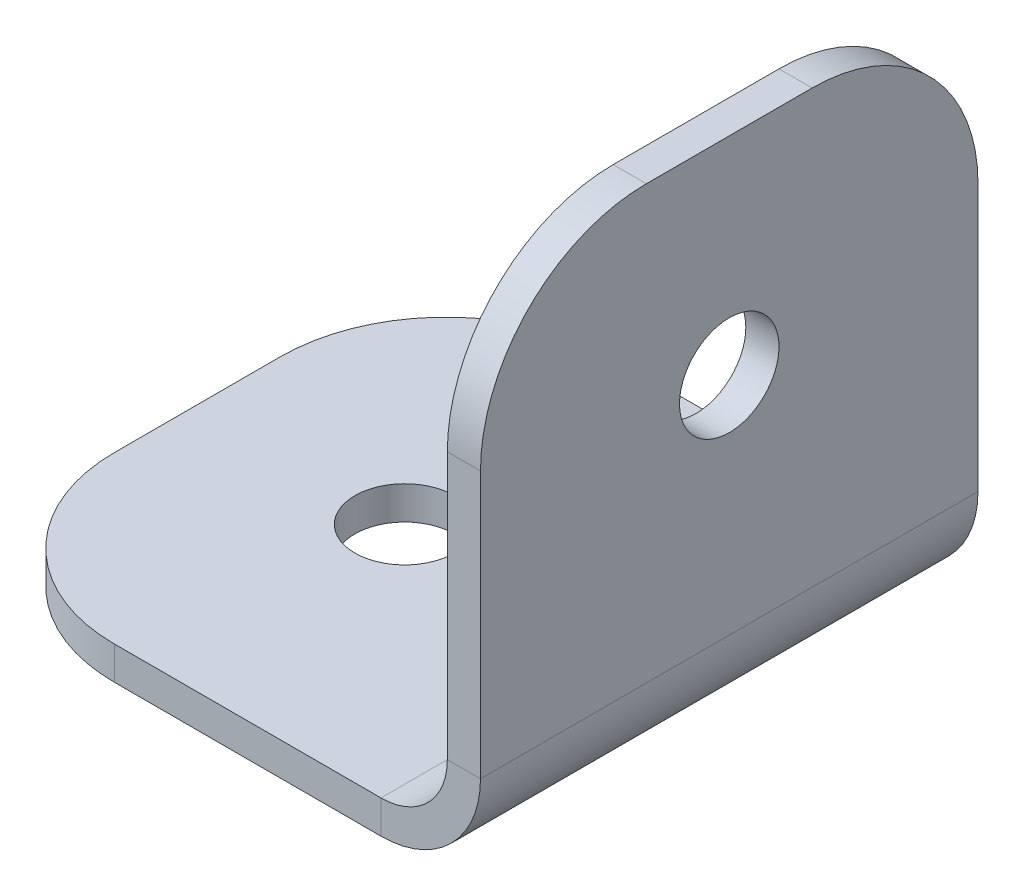
ISO-10303-21;
HEADER;
FILE_DESCRIPTION(('STEP AP214'),'2;1');
FILE_NAME('part.step','',(''),(''),'','','');
FILE_SCHEMA(('AUTOMOTIVE_DESIGN { 1 0 10303 214 1 1 1 1 }'));
ENDSEC;
DATA;
#1=APPLICATION_CONTEXT('core data for automotive mechanical design processes');
#2=APPLICATION_PROTOCOL_DEFINITION('international standard','automotive_design',2000,#1);
#3=PRODUCT_CONTEXT('',#1,'mechanical');
#4=PRODUCT('Part','Part','',(#3));
#5=PRODUCT_RELATED_PRODUCT_CATEGORY('part','',(#4));
#6=PRODUCT_DEFINITION_FORMATION('','',#4);
#7=PRODUCT_DEFINITION_CONTEXT('part definition',#1,'design');
#8=PRODUCT_DEFINITION('design','',#6,#7);
#9=PRODUCT_DEFINITION_SHAPE('','',#8);
#10=(LENGTH_UNIT() NAMED_UNIT(*) SI_UNIT(.MILLI.,.METRE.));
#11=(NAMED_UNIT(*) PLANE_ANGLE_UNIT() SI_UNIT($,.RADIAN.));
#12=(NAMED_UNIT(*) SI_UNIT($,.STERADIAN.) SOLID_ANGLE_UNIT());
#13=UNCERTAINTY_MEASURE_WITH_UNIT(LENGTH_MEASURE(1.E-05),#10,'distance_accuracy_value','');
#14=(GEOMETRIC_REPRESENTATION_CONTEXT(3) GLOBAL_UNCERTAINTY_ASSIGNED_CONTEXT((#13)) GLOBAL_UNIT_ASSIGNED_CONTEXT((#10,
#11,#12)) REPRESENTATION_CONTEXT('',''));
#15=CARTESIAN_POINT('',(0.,0.,0.));
#16=DIRECTION('',(0.,0.,1.));
#17=DIRECTION('',(1.,0.,0.));
#18=AXIS2_PLACEMENT_3D('',#15,#16,#17);
#19=CARTESIAN_POINT('',(0.0730091830128251,-17.9269908169872,-4.99999999999999));
#20=DIRECTION('',(1.,0.,0.));
#21=DIRECTION('',(0.,0.,-1.));
#22=AXIS2_PLACEMENT_3D('',#19,#20,#21);
#23=PLANE('',#22);
#24=CARTESIAN_POINT('',(0.073009183012692,19.5730091830128,0.));
#25=DIRECTION('',(-1.,0.,0.));
#26=DIRECTION('',(0.,0.,-1.));
#27=AXIS2_PLACEMENT_3D('',#24,#25,#26);
#28=CIRCLE('',#27,3.);
#29=CARTESIAN_POINT('',(0.0730091830126934,19.5730091830128,-3.00000000000001));
#30=VERTEX_POINT('',#29);
#31=EDGE_CURVE('E204',#30,#30,#28,.T.);
#32=ORIENTED_EDGE('',*,*,#31,.F.);
#33=EDGE_LOOP('',(#32));
#34=FACE_BOUND('',#33,.T.);
#35=DIRECTION('',(0.,-1.,0.));
#36=VECTOR('',#35,1.);
#37=CARTESIAN_POINT('',(0.0730091830128299,-17.9269908169872,-15.));
#38=LINE('',#37,#36);
#39=CARTESIAN_POINT('',(0.0730091830126903,22.0730091830128,-15.));
#40=VERTEX_POINT('',#39);
#41=CARTESIAN_POINT('',(0.0730091830127462,6.00000000000001,-15.));
#42=VERTEX_POINT('',#41);
#43=EDGE_CURVE('E42',#40,#42,#38,.T.);
#44=ORIENTED_EDGE('',*,*,#43,.T.);
#45=DIRECTION('',(0.,0.,1.));
#46=VECTOR('',#45,1.);
#47=CARTESIAN_POINT('',(0.0730091830127414,6.00000000000002,-4.99999999999999));
#48=LINE('',#47,#46);
#49=CARTESIAN_POINT('',(0.0730091830127401,6.00000000000002,15.));
#50=VERTEX_POINT('',#49);
#51=EDGE_CURVE('E151',#42,#50,#48,.T.);
#52=ORIENTED_EDGE('',*,*,#51,.T.);
#53=DIRECTION('',(0.,1.,0.));
#54=VECTOR('',#53,1.);
#55=CARTESIAN_POINT('',(0.073009183012816,-17.9269908169872,15.));
#56=LINE('',#55,#54);
#57=CARTESIAN_POINT('',(0.0730091830126764,22.0730091830128,15.));
#58=VERTEX_POINT('',#57);
#59=EDGE_CURVE('E198',#50,#58,#56,.T.);
#60=ORIENTED_EDGE('',*,*,#59,.T.);
#61=CARTESIAN_POINT('',(0.0730091830126811,22.0730091830128,4.99999999999999));
#62=DIRECTION('',(-1.,0.,0.));
#63=DIRECTION('',(0.,0.,1.));
#64=AXIS2_PLACEMENT_3D('',#61,#62,#63);
#65=CIRCLE('',#64,10.);
#66=CARTESIAN_POINT('',(0.073009183012646,32.0730091830128,4.99999999999999));
#67=VERTEX_POINT('',#66);
#68=EDGE_CURVE('E194',#58,#67,#65,.T.);
#69=ORIENTED_EDGE('',*,*,#68,.T.);
#70=DIRECTION('',(0.,0.,-1.));
#71=VECTOR('',#70,1.);
#72=CARTESIAN_POINT('',(0.073009183012646,32.0730091830128,4.99999999999999));
#73=LINE('',#72,#71);
#74=CARTESIAN_POINT('',(0.0730091830126504,32.0730091830128,-5.00000000000001));
#75=VERTEX_POINT('',#74);
#76=EDGE_CURVE('E197',#67,#75,#73,.T.);
#77=ORIENTED_EDGE('',*,*,#76,.T.);
#78=CARTESIAN_POINT('',(0.0730091830126855,22.0730091830128,-5.00000000000001));
#79=DIRECTION('',(-1.,0.,0.));
#80=DIRECTION('',(0.,0.,-1.));
#81=AXIS2_PLACEMENT_3D('',#78,#79,#80);
#82=CIRCLE('',#81,10.);
#83=EDGE_CURVE('E201',#75,#40,#82,.T.);
#84=ORIENTED_EDGE('',*,*,#83,.T.);
#85=EDGE_LOOP('',(#44,#52,#60,#69,#77,#84));
#86=FACE_BOUND('',#85,.T.);
#87=ADVANCED_FACE('F38',(#34,#86),#23,.F.);
#88=CARTESIAN_POINT('',(0.073009183012816,-17.9269908169872,15.));
#89=DIRECTION('',(0.,0.,-1.));
#90=DIRECTION('',(0.,1.,0.));
#91=AXIS2_PLACEMENT_3D('',#88,#89,#90);
#92=PLANE('',#91);
#93=DIRECTION('',(-1.,0.,0.));
#94=VECTOR('',#93,1.);
#95=CARTESIAN_POINT('',(0.0730091830127323,6.00000000000002,15.));
#96=LINE('',#95,#94);
#97=CARTESIAN_POINT('',(2.07300918301273,6.00000000000003,15.));
#98=VERTEX_POINT('',#97);
#99=EDGE_CURVE('E12',#98,#50,#96,.T.);
#100=ORIENTED_EDGE('',*,*,#99,.F.);
#101=DIRECTION('',(0.,1.,0.));
#102=VECTOR('',#101,1.);
#103=CARTESIAN_POINT('',(2.07300918301282,-17.9269908169872,15.));
#104=LINE('',#103,#102);
#105=CARTESIAN_POINT('',(2.07300918301268,22.0730091830128,15.));
#106=VERTEX_POINT('',#105);
#107=EDGE_CURVE('E55',#98,#106,#104,.T.);
#108=ORIENTED_EDGE('',*,*,#107,.T.);
#109=DIRECTION('',(-1.,0.,0.));
#110=VECTOR('',#109,1.);
#111=CARTESIAN_POINT('',(0.0730091830126764,22.0730091830128,15.));
#112=LINE('',#111,#110);
#113=EDGE_CURVE('E225',#106,#58,#112,.T.);
#114=ORIENTED_EDGE('',*,*,#113,.T.);
#115=ORIENTED_EDGE('',*,*,#59,.F.);
#116=EDGE_LOOP('',(#100,#108,#114,#115));
#117=FACE_BOUND('',#116,.T.);
#118=ADVANCED_FACE('F40',(#117),#92,.F.);
#119=CARTESIAN_POINT('',(0.0730091830126811,22.0730091830128,4.99999999999999));
#120=DIRECTION('',(-1.,0.,0.));
#121=DIRECTION('',(0.,0.,1.));
#122=AXIS2_PLACEMENT_3D('',#119,#120,#121);
#123=CYLINDRICAL_SURFACE('',#122,10.);
#124=ORIENTED_EDGE('',*,*,#113,.F.);
#125=CARTESIAN_POINT('',(2.07300918301268,22.0730091830128,4.99999999999999));
#126=DIRECTION('',(-1.,0.,0.));
#127=DIRECTION('',(0.,0.,1.));
#128=AXIS2_PLACEMENT_3D('',#125,#126,#127);
#129=CIRCLE('',#128,10.);
#130=CARTESIAN_POINT('',(2.07300918301265,32.0730091830128,4.99999999999999));
#131=VERTEX_POINT('',#130);
#132=EDGE_CURVE('E214',#106,#131,#129,.T.);
#133=ORIENTED_EDGE('',*,*,#132,.T.);
#134=DIRECTION('',(-1.,0.,0.));
#135=VECTOR('',#134,1.);
#136=CARTESIAN_POINT('',(0.073009183012646,32.0730091830128,4.99999999999999));
#137=LINE('',#136,#135);
#138=EDGE_CURVE('E223',#131,#67,#137,.T.);
#139=ORIENTED_EDGE('',*,*,#138,.T.);
#140=ORIENTED_EDGE('',*,*,#68,.F.);
#141=EDGE_LOOP('',(#124,#133,#139,#140));
#142=FACE_BOUND('',#141,.T.);
#143=ADVANCED_FACE('F241',(#142),#123,.T.);
#144=CARTESIAN_POINT('',(0.073009183012646,32.0730091830128,4.99999999999999));
#145=DIRECTION('',(0.,-1.,0.));
#146=DIRECTION('',(0.,0.,-1.));
#147=AXIS2_PLACEMENT_3D('',#144,#145,#146);
#148=PLANE('',#147);
#149=ORIENTED_EDGE('',*,*,#138,.F.);
#150=DIRECTION('',(0.,0.,-1.));
#151=VECTOR('',#150,1.);
#152=CARTESIAN_POINT('',(2.07300918301265,32.0730091830128,-5.00000000000001));
#153=LINE('',#152,#151);
#154=CARTESIAN_POINT('',(2.07300918301265,32.0730091830128,-5.00000000000001));
#155=VERTEX_POINT('',#154);
#156=EDGE_CURVE('E211',#131,#155,#153,.T.);
#157=ORIENTED_EDGE('',*,*,#156,.T.);
#158=DIRECTION('',(-1.,0.,0.));
#159=VECTOR('',#158,1.);
#160=CARTESIAN_POINT('',(0.0730091830126504,32.0730091830128,-5.00000000000001));
#161=LINE('',#160,#159);
#162=EDGE_CURVE('E221',#155,#75,#161,.T.);
#163=ORIENTED_EDGE('',*,*,#162,.T.);
#164=ORIENTED_EDGE('',*,*,#76,.F.);
#165=EDGE_LOOP('',(#149,#157,#163,#164));
#166=FACE_BOUND('',#165,.T.);
#167=ADVANCED_FACE('F244',(#166),#148,.F.);
#168=CARTESIAN_POINT('',(0.0730091830126855,22.0730091830128,-5.00000000000001));
#169=DIRECTION('',(-1.,0.,0.));
#170=DIRECTION('',(0.,0.,1.));
#171=AXIS2_PLACEMENT_3D('',#168,#169,#170);
#172=CYLINDRICAL_SURFACE('',#171,10.);
#173=ORIENTED_EDGE('',*,*,#162,.F.);
#174=CARTESIAN_POINT('',(2.07300918301269,22.0730091830128,-5.00000000000001));
#175=DIRECTION('',(-1.,0.,0.));
#176=DIRECTION('',(0.,0.,1.));
#177=AXIS2_PLACEMENT_3D('',#174,#175,#176);
#178=CIRCLE('',#177,10.);
#179=CARTESIAN_POINT('',(2.07300918301269,22.0730091830128,-15.));
#180=VERTEX_POINT('',#179);
#181=EDGE_CURVE('E208',#155,#180,#178,.T.);
#182=ORIENTED_EDGE('',*,*,#181,.T.);
#183=DIRECTION('',(-1.,0.,0.));
#184=VECTOR('',#183,1.);
#185=CARTESIAN_POINT('',(0.0730091830126903,22.0730091830128,-15.));
#186=LINE('',#185,#184);
#187=EDGE_CURVE('E207',#180,#40,#186,.T.);
#188=ORIENTED_EDGE('',*,*,#187,.T.);
#189=ORIENTED_EDGE('',*,*,#83,.F.);
#190=EDGE_LOOP('',(#173,#182,#188,#189));
#191=FACE_BOUND('',#190,.T.);
#192=ADVANCED_FACE('F249',(#191),#172,.T.);
#193=CARTESIAN_POINT('',(0.0730091830128299,-17.9269908169872,-15.));
#194=DIRECTION('',(0.,0.,1.));
#195=DIRECTION('',(0.,-1.,0.));
#196=AXIS2_PLACEMENT_3D('',#193,#194,#195);
#197=PLANE('',#196);
#198=DIRECTION('',(1.,0.,0.));
#199=VECTOR('',#198,1.);
#200=CARTESIAN_POINT('',(0.0730091830127462,6.00000000000002,-15.));
#201=LINE('',#200,#199);
#202=CARTESIAN_POINT('',(2.07300918301275,6.00000000000002,-15.));
#203=VERTEX_POINT('',#202);
#204=EDGE_CURVE('E229',#42,#203,#201,.T.);
#205=ORIENTED_EDGE('',*,*,#204,.F.);
#206=ORIENTED_EDGE('',*,*,#43,.F.);
#207=ORIENTED_EDGE('',*,*,#187,.F.);
#208=DIRECTION('',(0.,1.,0.));
#209=VECTOR('',#208,1.);
#210=CARTESIAN_POINT('',(2.07300918301283,-17.9269908169872,-15.));
#211=LINE('',#210,#209);
#212=EDGE_CURVE('E63',#180,#203,#211,.F.);
#213=ORIENTED_EDGE('',*,*,#212,.T.);
#214=EDGE_LOOP('',(#205,#206,#207,#213));
#215=FACE_BOUND('',#214,.T.);
#216=ADVANCED_FACE('F252',(#215),#197,.F.);
#217=CARTESIAN_POINT('',(0.073009183012692,19.5730091830128,0.));
#218=DIRECTION('',(-1.,0.,0.));
#219=DIRECTION('',(0.,0.,1.));
#220=AXIS2_PLACEMENT_3D('',#217,#218,#219);
#221=CYLINDRICAL_SURFACE('',#220,3.);
#222=ORIENTED_EDGE('',*,*,#31,.T.);
#223=EDGE_LOOP('',(#222));
#224=FACE_BOUND('',#223,.T.);
#225=CARTESIAN_POINT('',(2.07300918301269,19.5730091830128,0.));
#226=DIRECTION('',(-1.,0.,0.));
#227=DIRECTION('',(0.,0.,1.));
#228=AXIS2_PLACEMENT_3D('',#225,#226,#227);
#229=CIRCLE('',#228,3.);
#230=CARTESIAN_POINT('',(2.07300918301269,19.5730091830128,2.99999999999999));
#231=VERTEX_POINT('',#230);
#232=EDGE_CURVE('E217',#231,#231,#229,.T.);
#233=ORIENTED_EDGE('',*,*,#232,.F.);
#234=EDGE_LOOP('',(#233));
#235=FACE_BOUND('',#234,.T.);
#236=ADVANCED_FACE('F311',(#224,#235),#221,.F.);
#237=CARTESIAN_POINT('',(2.07300918301283,-17.9269908169872,-4.99999999999999));
#238=DIRECTION('',(1.,0.,0.));
#239=DIRECTION('',(0.,0.,-1.));
#240=AXIS2_PLACEMENT_3D('',#237,#238,#239);
#241=PLANE('',#240);
#242=DIRECTION('',(0.,0.,1.));
#243=VECTOR('',#242,1.);
#244=CARTESIAN_POINT('',(2.07300918301274,6.00000000000003,-4.99999999999999));
#245=LINE('',#244,#243);
#246=EDGE_CURVE('E47',#203,#98,#245,.T.);
#247=ORIENTED_EDGE('',*,*,#246,.F.);
#248=ORIENTED_EDGE('',*,*,#212,.F.);
#249=ORIENTED_EDGE('',*,*,#181,.F.);
#250=ORIENTED_EDGE('',*,*,#156,.F.);
#251=ORIENTED_EDGE('',*,*,#132,.F.);
#252=ORIENTED_EDGE('',*,*,#107,.F.);
#253=EDGE_LOOP('',(#247,#248,#249,#250,#251,#252));
#254=FACE_BOUND('',#253,.T.);
#255=ORIENTED_EDGE('',*,*,#232,.T.);
#256=EDGE_LOOP('',(#255));
#257=FACE_BOUND('',#256,.T.);
#258=ADVANCED_FACE('F246',(#254,#257),#241,.T.);
#259=CARTESIAN_POINT('',(-17.5,2.,0.));
#260=DIRECTION('',(0.,1.,0.));
#261=DIRECTION('',(0.,0.,1.));
#262=AXIS2_PLACEMENT_3D('',#259,#260,#261);
#263=CYLINDRICAL_SURFACE('',#262,3.);
#264=CARTESIAN_POINT('',(-17.5,2.,0.));
#265=DIRECTION('',(0.,1.,0.));
#266=DIRECTION('',(0.,0.,1.));
#267=AXIS2_PLACEMENT_3D('',#264,#265,#266);
#268=CIRCLE('',#267,3.);
#269=CARTESIAN_POINT('',(-17.5,2.,3.));
#270=VERTEX_POINT('',#269);
#271=EDGE_CURVE('E165',#270,#270,#268,.T.);
#272=ORIENTED_EDGE('',*,*,#271,.T.);
#273=EDGE_LOOP('',(#272));
#274=FACE_BOUND('',#273,.T.);
#275=CARTESIAN_POINT('',(-17.5,0.,0.));
#276=DIRECTION('',(0.,1.,0.));
#277=DIRECTION('',(0.,0.,1.));
#278=AXIS2_PLACEMENT_3D('',#275,#276,#277);
#279=CIRCLE('',#278,3.);
#280=CARTESIAN_POINT('',(-17.5,0.,3.));
#281=VERTEX_POINT('',#280);
#282=EDGE_CURVE('E269',#281,#281,#279,.T.);
#283=ORIENTED_EDGE('',*,*,#282,.F.);
#284=EDGE_LOOP('',(#283));
#285=FACE_BOUND('',#284,.T.);
#286=ADVANCED_FACE('F300',(#274,#285),#263,.F.);
#287=CARTESIAN_POINT('',(-20.,2.,5.));
#288=DIRECTION('',(0.,1.,0.));
#289=DIRECTION('',(0.,0.,1.));
#290=AXIS2_PLACEMENT_3D('',#287,#288,#289);
#291=CYLINDRICAL_SURFACE('',#290,10.);
#292=DIRECTION('',(0.,1.,0.));
#293=VECTOR('',#292,1.);
#294=CARTESIAN_POINT('',(-30.,2.,5.));
#295=LINE('',#294,#293);
#296=CARTESIAN_POINT('',(-30.,0.,5.));
#297=VERTEX_POINT('',#296);
#298=CARTESIAN_POINT('',(-30.,2.,5.));
#299=VERTEX_POINT('',#298);
#300=EDGE_CURVE('E182',#297,#299,#295,.T.);
#301=ORIENTED_EDGE('',*,*,#300,.F.);
#302=CARTESIAN_POINT('',(-20.,0.,5.));
#303=DIRECTION('',(0.,1.,0.));
#304=DIRECTION('',(0.,0.,1.));
#305=AXIS2_PLACEMENT_3D('',#302,#303,#304);
#306=CIRCLE('',#305,10.);
#307=CARTESIAN_POINT('',(-20.,0.,15.));
#308=VERTEX_POINT('',#307);
#309=EDGE_CURVE('E189',#297,#308,#306,.T.);
#310=ORIENTED_EDGE('',*,*,#309,.T.);
#311=DIRECTION('',(0.,1.,0.));
#312=VECTOR('',#311,1.);
#313=CARTESIAN_POINT('',(-20.,2.,15.));
#314=LINE('',#313,#312);
#315=CARTESIAN_POINT('',(-20.,2.,15.));
#316=VERTEX_POINT('',#315);
#317=EDGE_CURVE('E187',#308,#316,#314,.T.);
#318=ORIENTED_EDGE('',*,*,#317,.T.);
#319=CARTESIAN_POINT('',(-20.,2.,5.));
#320=DIRECTION('',(0.,1.,0.));
#321=DIRECTION('',(0.,0.,-1.));
#322=AXIS2_PLACEMENT_3D('',#319,#320,#321);
#323=CIRCLE('',#322,10.);
#324=EDGE_CURVE('E275',#299,#316,#323,.T.);
#325=ORIENTED_EDGE('',*,*,#324,.F.);
#326=EDGE_LOOP('',(#301,#310,#318,#325));
#327=FACE_BOUND('',#326,.T.);
#328=ADVANCED_FACE('F281',(#327),#291,.T.);
#329=CARTESIAN_POINT('',(-30.,2.,5.));
#330=DIRECTION('',(1.,0.,0.));
#331=DIRECTION('',(0.,0.,1.));
#332=AXIS2_PLACEMENT_3D('',#329,#330,#331);
#333=PLANE('',#332);
#334=DIRECTION('',(0.,0.,-1.));
#335=VECTOR('',#334,1.);
#336=CARTESIAN_POINT('',(-30.,0.,-5.));
#337=LINE('',#336,#335);
#338=CARTESIAN_POINT('',(-30.,0.,-5.));
#339=VERTEX_POINT('',#338);
#340=EDGE_CURVE('E184',#339,#297,#337,.F.);
#341=ORIENTED_EDGE('',*,*,#340,.T.);
#342=ORIENTED_EDGE('',*,*,#300,.T.);
#343=DIRECTION('',(0.,0.,1.));
#344=VECTOR('',#343,1.);
#345=CARTESIAN_POINT('',(-30.,2.,5.));
#346=LINE('',#345,#344);
#347=CARTESIAN_POINT('',(-30.,2.,-5.));
#348=VERTEX_POINT('',#347);
#349=EDGE_CURVE('E174',#348,#299,#346,.T.);
#350=ORIENTED_EDGE('',*,*,#349,.F.);
#351=DIRECTION('',(0.,1.,0.));
#352=VECTOR('',#351,1.);
#353=CARTESIAN_POINT('',(-30.,2.,-5.));
#354=LINE('',#353,#352);
#355=EDGE_CURVE('E172',#339,#348,#354,.T.);
#356=ORIENTED_EDGE('',*,*,#355,.F.);
#357=EDGE_LOOP('',(#341,#342,#350,#356));
#358=FACE_BOUND('',#357,.T.);
#359=ADVANCED_FACE('F292',(#358),#333,.F.);
#360=CARTESIAN_POINT('',(-20.,2.,-5.));
#361=DIRECTION('',(0.,1.,0.));
#362=DIRECTION('',(0.,0.,1.));
#363=AXIS2_PLACEMENT_3D('',#360,#361,#362);
#364=CYLINDRICAL_SURFACE('',#363,10.);
#365=DIRECTION('',(0.,1.,0.));
#366=VECTOR('',#365,1.);
#367=CARTESIAN_POINT('',(-20.,2.,-15.));
#368=LINE('',#367,#366);
#369=CARTESIAN_POINT('',(-20.,0.,-15.));
#370=VERTEX_POINT('',#369);
#371=CARTESIAN_POINT('',(-20.,2.,-15.));
#372=VERTEX_POINT('',#371);
#373=EDGE_CURVE('E169',#370,#372,#368,.T.);
#374=ORIENTED_EDGE('',*,*,#373,.F.);
#375=CARTESIAN_POINT('',(-20.,0.,-5.));
#376=DIRECTION('',(0.,1.,0.));
#377=DIRECTION('',(0.,0.,1.));
#378=AXIS2_PLACEMENT_3D('',#375,#376,#377);
#379=CIRCLE('',#378,10.);
#380=EDGE_CURVE('E176',#370,#339,#379,.T.);
#381=ORIENTED_EDGE('',*,*,#380,.T.);
#382=ORIENTED_EDGE('',*,*,#355,.T.);
#383=CARTESIAN_POINT('',(-20.,2.,-5.));
#384=DIRECTION('',(0.,1.,0.));
#385=DIRECTION('',(0.,0.,-1.));
#386=AXIS2_PLACEMENT_3D('',#383,#384,#385);
#387=CIRCLE('',#386,10.);
#388=EDGE_CURVE('E171',#372,#348,#387,.T.);
#389=ORIENTED_EDGE('',*,*,#388,.F.);
#390=EDGE_LOOP('',(#374,#381,#382,#389));
#391=FACE_BOUND('',#390,.T.);
#392=ADVANCED_FACE('F291',(#391),#364,.T.);
#393=CARTESIAN_POINT('',(-20.,2.,-5.));
#394=DIRECTION('',(0.,-1.,0.));
#395=DIRECTION('',(0.,0.,-1.));
#396=AXIS2_PLACEMENT_3D('',#393,#394,#395);
#397=PLANE('',#396);
#398=DIRECTION('',(0.,0.,1.));
#399=VECTOR('',#398,1.);
#400=CARTESIAN_POINT('',(-3.92699081698725,2.,-4.99999999999999));
#401=LINE('',#400,#399);
#402=CARTESIAN_POINT('',(-3.92699081698725,2.,-15.));
#403=VERTEX_POINT('',#402);
#404=CARTESIAN_POINT('',(-3.92699081698726,2.,15.));
#405=VERTEX_POINT('',#404);
#406=EDGE_CURVE('E148',#403,#405,#401,.T.);
#407=ORIENTED_EDGE('',*,*,#406,.F.);
#408=DIRECTION('',(-1.,0.,0.));
#409=VECTOR('',#408,1.);
#410=CARTESIAN_POINT('',(-20.,2.,-15.));
#411=LINE('',#410,#409);
#412=EDGE_CURVE('E160',#403,#372,#411,.T.);
#413=ORIENTED_EDGE('',*,*,#412,.T.);
#414=ORIENTED_EDGE('',*,*,#388,.T.);
#415=ORIENTED_EDGE('',*,*,#349,.T.);
#416=ORIENTED_EDGE('',*,*,#324,.T.);
#417=DIRECTION('',(1.,0.,0.));
#418=VECTOR('',#417,1.);
#419=CARTESIAN_POINT('',(-20.,2.,15.));
#420=LINE('',#419,#418);
#421=EDGE_CURVE('E142',#316,#405,#420,.T.);
#422=ORIENTED_EDGE('',*,*,#421,.T.);
#423=EDGE_LOOP('',(#407,#413,#414,#415,#416,#422));
#424=FACE_BOUND('',#423,.T.);
#425=ORIENTED_EDGE('',*,*,#271,.F.);
#426=EDGE_LOOP('',(#425));
#427=FACE_BOUND('',#426,.T.);
#428=ADVANCED_FACE('F157',(#424,#427),#397,.F.);
#429=CARTESIAN_POINT('',(-20.,2.,-15.));
#430=DIRECTION('',(0.,0.,1.));
#431=DIRECTION('',(-1.,0.,0.));
#432=AXIS2_PLACEMENT_3D('',#429,#430,#431);
#433=PLANE('',#432);
#434=ORIENTED_EDGE('',*,*,#412,.F.);
#435=DIRECTION('',(0.,-1.,0.));
#436=VECTOR('',#435,1.);
#437=CARTESIAN_POINT('',(-3.92699081698725,2.,-15.));
#438=LINE('',#437,#436);
#439=CARTESIAN_POINT('',(-3.92699081698725,0.,-15.));
#440=VERTEX_POINT('',#439);
#441=EDGE_CURVE('E130',#403,#440,#438,.T.);
#442=ORIENTED_EDGE('',*,*,#441,.T.);
#443=DIRECTION('',(1.,0.,0.));
#444=VECTOR('',#443,1.);
#445=CARTESIAN_POINT('',(-20.,0.,-15.));
#446=LINE('',#445,#444);
#447=EDGE_CURVE('E141',#440,#370,#446,.F.);
#448=ORIENTED_EDGE('',*,*,#447,.T.);
#449=ORIENTED_EDGE('',*,*,#373,.T.);
#450=EDGE_LOOP('',(#434,#442,#448,#449));
#451=FACE_BOUND('',#450,.T.);
#452=ADVANCED_FACE('F167',(#451),#433,.F.);
#453=CARTESIAN_POINT('',(-20.,0.,-5.));
#454=DIRECTION('',(0.,-1.,0.));
#455=DIRECTION('',(0.,0.,-1.));
#456=AXIS2_PLACEMENT_3D('',#453,#454,#455);
#457=PLANE('',#456);
#458=ORIENTED_EDGE('',*,*,#282,.T.);
#459=EDGE_LOOP('',(#458));
#460=FACE_BOUND('',#459,.T.);
#461=ORIENTED_EDGE('',*,*,#447,.F.);
#462=DIRECTION('',(0.,0.,1.));
#463=VECTOR('',#462,1.);
#464=CARTESIAN_POINT('',(-3.92699081698725,0.,-4.99999999999999));
#465=LINE('',#464,#463);
#466=CARTESIAN_POINT('',(-3.92699081698725,0.,15.));
#467=VERTEX_POINT('',#466);
#468=EDGE_CURVE('E257',#440,#467,#465,.T.);
#469=ORIENTED_EDGE('',*,*,#468,.T.);
#470=DIRECTION('',(1.,0.,0.));
#471=VECTOR('',#470,1.);
#472=CARTESIAN_POINT('',(-20.,0.,15.));
#473=LINE('',#472,#471);
#474=EDGE_CURVE('E265',#308,#467,#473,.T.);
#475=ORIENTED_EDGE('',*,*,#474,.F.);
#476=ORIENTED_EDGE('',*,*,#309,.F.);
#477=ORIENTED_EDGE('',*,*,#340,.F.);
#478=ORIENTED_EDGE('',*,*,#380,.F.);
#479=EDGE_LOOP('',(#461,#469,#475,#476,#477,#478));
#480=FACE_BOUND('',#479,.T.);
#481=ADVANCED_FACE('F287',(#460,#480),#457,.T.);
#482=CARTESIAN_POINT('',(-20.,2.,15.));
#483=DIRECTION('',(0.,0.,-1.));
#484=DIRECTION('',(1.,0.,0.));
#485=AXIS2_PLACEMENT_3D('',#482,#483,#484);
#486=PLANE('',#485);
#487=ORIENTED_EDGE('',*,*,#474,.T.);
#488=DIRECTION('',(0.,1.,0.));
#489=VECTOR('',#488,1.);
#490=CARTESIAN_POINT('',(-3.92699081698726,2.,15.));
#491=LINE('',#490,#489);
#492=EDGE_CURVE('E234',#467,#405,#491,.T.);
#493=ORIENTED_EDGE('',*,*,#492,.T.);
#494=ORIENTED_EDGE('',*,*,#421,.F.);
#495=ORIENTED_EDGE('',*,*,#317,.F.);
#496=EDGE_LOOP('',(#487,#493,#494,#495));
#497=FACE_BOUND('',#496,.T.);
#498=ADVANCED_FACE('F285',(#497),#486,.F.);
#499=CARTESIAN_POINT('',(-3.92699081698725,6.,-15.));
#500=DIRECTION('',(0.,0.,1.));
#501=DIRECTION('',(1.,0.,0.));
#502=AXIS2_PLACEMENT_3D('',#499,#500,#501);
#503=PLANE('',#502);
#504=ORIENTED_EDGE('',*,*,#204,.T.);
#505=CARTESIAN_POINT('',(-3.92699081698725,6.,-15.));
#506=DIRECTION('',(0.,0.,-1.));
#507=DIRECTION('',(-1.,0.,0.));
#508=AXIS2_PLACEMENT_3D('',#505,#506,#507);
#509=CIRCLE('',#508,6.);
#510=EDGE_CURVE('E137',#203,#440,#509,.T.);
#511=ORIENTED_EDGE('',*,*,#510,.T.);
#512=ORIENTED_EDGE('',*,*,#441,.F.);
#513=CARTESIAN_POINT('',(-3.92699081698725,6.,-15.));
#514=DIRECTION('',(0.,0.,-1.));
#515=DIRECTION('',(-1.,0.,0.));
#516=AXIS2_PLACEMENT_3D('',#513,#514,#515);
#517=CIRCLE('',#516,4.);
#518=EDGE_CURVE('E134',#42,#403,#517,.T.);
#519=ORIENTED_EDGE('',*,*,#518,.F.);
#520=EDGE_LOOP('',(#504,#511,#512,#519));
#521=FACE_BOUND('',#520,.T.);
#522=ADVANCED_FACE('F133',(#521),#503,.F.);
#523=CARTESIAN_POINT('',(-3.92699081698726,6.,15.));
#524=DIRECTION('',(0.,0.,-1.));
#525=DIRECTION('',(-1.,0.,0.));
#526=AXIS2_PLACEMENT_3D('',#523,#524,#525);
#527=PLANE('',#526);
#528=ORIENTED_EDGE('',*,*,#492,.F.);
#529=CARTESIAN_POINT('',(-3.92699081698726,6.,15.));
#530=DIRECTION('',(0.,0.,-1.));
#531=DIRECTION('',(-1.,0.,0.));
#532=AXIS2_PLACEMENT_3D('',#529,#530,#531);
#533=CIRCLE('',#532,6.);
#534=EDGE_CURVE('E153',#467,#98,#533,.F.);
#535=ORIENTED_EDGE('',*,*,#534,.T.);
#536=ORIENTED_EDGE('',*,*,#99,.T.);
#537=CARTESIAN_POINT('',(-3.92699081698726,6.,15.));
#538=DIRECTION('',(0.,0.,1.));
#539=DIRECTION('',(1.,0.,0.));
#540=AXIS2_PLACEMENT_3D('',#537,#538,#539);
#541=CIRCLE('',#540,4.);
#542=EDGE_CURVE('E152',#405,#50,#541,.T.);
#543=ORIENTED_EDGE('',*,*,#542,.F.);
#544=EDGE_LOOP('',(#528,#535,#536,#543));
#545=FACE_BOUND('',#544,.T.);
#546=ADVANCED_FACE('F397',(#545),#527,.F.);
#547=CARTESIAN_POINT('',(-3.92699081698727,6.,31.0754730858085));
#548=DIRECTION('',(0.,0.,-1.));
#549=DIRECTION('',(-1.,0.,0.));
#550=AXIS2_PLACEMENT_3D('',#547,#548,#549);
#551=CYLINDRICAL_SURFACE('',#550,4.);
#552=ORIENTED_EDGE('',*,*,#542,.T.);
#553=ORIENTED_EDGE('',*,*,#51,.F.);
#554=ORIENTED_EDGE('',*,*,#518,.T.);
#555=ORIENTED_EDGE('',*,*,#406,.T.);
#556=EDGE_LOOP('',(#552,#553,#554,#555));
#557=FACE_BOUND('',#556,.T.);
#558=ADVANCED_FACE('F147',(#557),#551,.F.);
#559=CARTESIAN_POINT('',(-3.92699081698727,6.,31.0754730858085));
#560=DIRECTION('',(0.,0.,-1.));
#561=DIRECTION('',(-1.,0.,0.));
#562=AXIS2_PLACEMENT_3D('',#559,#560,#561);
#563=CYLINDRICAL_SURFACE('',#562,6.);
#564=ORIENTED_EDGE('',*,*,#534,.F.);
#565=ORIENTED_EDGE('',*,*,#468,.F.);
#566=ORIENTED_EDGE('',*,*,#510,.F.);
#567=ORIENTED_EDGE('',*,*,#246,.T.);
#568=EDGE_LOOP('',(#564,#565,#566,#567));
#569=FACE_BOUND('',#568,.T.);
#570=ADVANCED_FACE('F255',(#569),#563,.T.);
#571=CLOSED_SHELL('',(#87,#118,#143,#167,#192,#216,#236,#258,#286,#328,#359,#392,#428,#452,#481,
#498,#522,#546,#558,#570));
#572=MANIFOLD_SOLID_BREP('B2',#571);
#573=ADVANCED_BREP_SHAPE_REPRESENTATION('',(#18,#572),#14);
#574=SHAPE_DEFINITION_REPRESENTATION(#9,#573);
ENDSEC;
END-ISO-10303-21;
